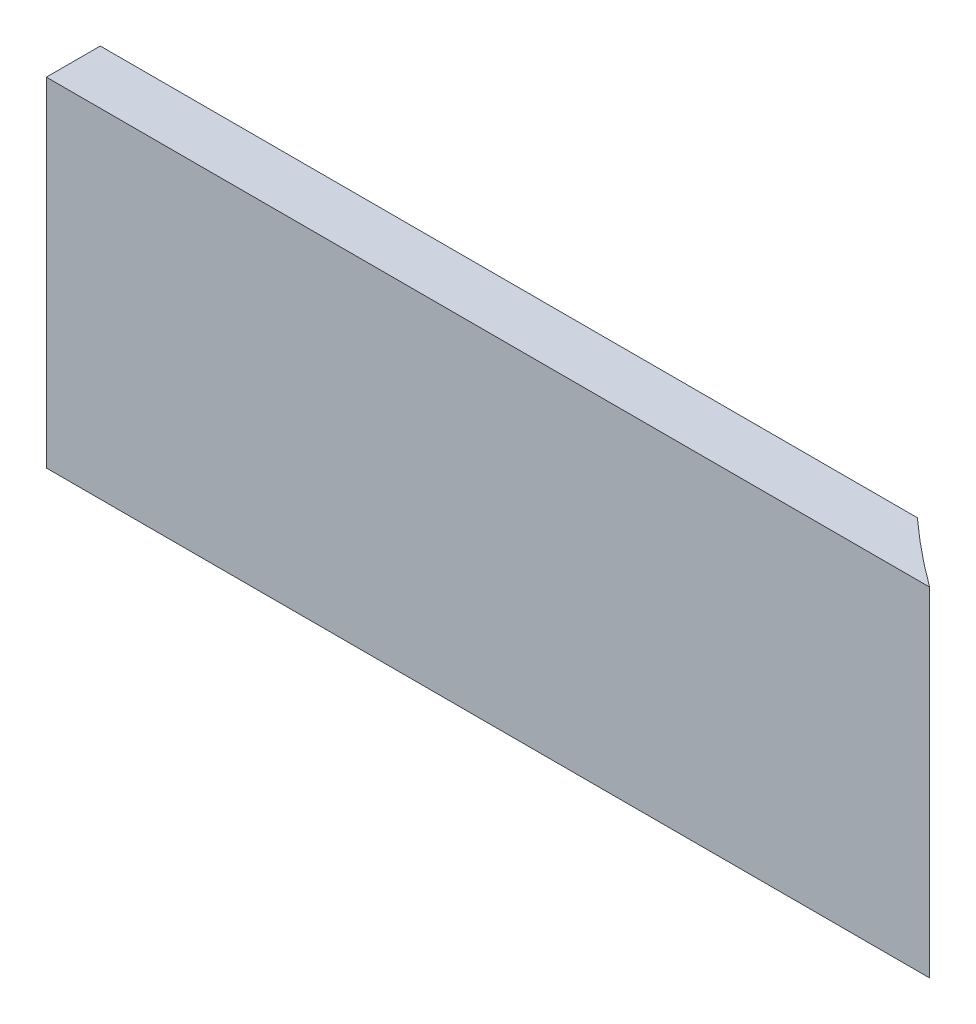
ISO-10303-21;
HEADER;
FILE_DESCRIPTION(('STEP AP214'),'2;1');
FILE_NAME('part.step','',(''),(''),'','','');
FILE_SCHEMA(('AUTOMOTIVE_DESIGN { 1 0 10303 214 1 1 1 1 }'));
ENDSEC;
DATA;
#1=APPLICATION_CONTEXT('core data for automotive mechanical design processes');
#2=APPLICATION_PROTOCOL_DEFINITION('international standard','automotive_design',2000,#1);
#3=PRODUCT_CONTEXT('',#1,'mechanical');
#4=PRODUCT('Part','Part','',(#3));
#5=PRODUCT_RELATED_PRODUCT_CATEGORY('part','',(#4));
#6=PRODUCT_DEFINITION_FORMATION('','',#4);
#7=PRODUCT_DEFINITION_CONTEXT('part definition',#1,'design');
#8=PRODUCT_DEFINITION('design','',#6,#7);
#9=PRODUCT_DEFINITION_SHAPE('','',#8);
#10=(LENGTH_UNIT() NAMED_UNIT(*) SI_UNIT(.MILLI.,.METRE.));
#11=(NAMED_UNIT(*) PLANE_ANGLE_UNIT() SI_UNIT($,.RADIAN.));
#12=(NAMED_UNIT(*) SI_UNIT($,.STERADIAN.) SOLID_ANGLE_UNIT());
#13=UNCERTAINTY_MEASURE_WITH_UNIT(LENGTH_MEASURE(1.E-05),#10,'distance_accuracy_value','');
#14=(GEOMETRIC_REPRESENTATION_CONTEXT(3) GLOBAL_UNCERTAINTY_ASSIGNED_CONTEXT((#13)) GLOBAL_UNIT_ASSIGNED_CONTEXT((#10,
#11,#12)) REPRESENTATION_CONTEXT('',''));
#15=CARTESIAN_POINT('',(0.,0.,0.));
#16=DIRECTION('',(0.,0.,1.));
#17=DIRECTION('',(1.,0.,0.));
#18=AXIS2_PLACEMENT_3D('',#15,#16,#17);
#19=CARTESIAN_POINT('',(297.5,-105.,33.45));
#20=DIRECTION('',(0.,1.,0.));
#21=DIRECTION('',(-1.,0.,0.));
#22=AXIS2_PLACEMENT_3D('',#19,#20,#21);
#23=PLANE('',#22);
#24=CARTESIAN_POINT('',(534.801270012683,-104.999999999997,-357.52304348203));
#25=DIRECTION('',(0.,-1.,0.));
#26=DIRECTION('',(0.87458306420189,0.,0.484875719964644));
#27=AXIS2_PLACEMENT_3D('',#24,#25,#26);
#28=CIRCLE('',#27,483.45);
#29=CARTESIAN_POINT('',(250.435340670944,-104.999999999999,33.4500000000107));
#30=VERTEX_POINT('',#29);
#31=CARTESIAN_POINT('',(209.376661417471,-105.,0.));
#32=VERTEX_POINT('',#31);
#33=EDGE_CURVE('E12',#30,#32,#28,.T.);
#34=ORIENTED_EDGE('',*,*,#33,.F.);
#35=DIRECTION('',(1.,0.,0.));
#36=VECTOR('',#35,1.);
#37=CARTESIAN_POINT('',(297.5,-105.,33.45));
#38=LINE('',#37,#36);
#39=CARTESIAN_POINT('',(-297.5,-105.,33.45));
#40=VERTEX_POINT('',#39);
#41=EDGE_CURVE('E95',#40,#30,#38,.T.);
#42=ORIENTED_EDGE('',*,*,#41,.F.);
#43=DIRECTION('',(0.,0.,-1.));
#44=VECTOR('',#43,1.);
#45=CARTESIAN_POINT('',(-297.5,-105.,33.45));
#46=LINE('',#45,#44);
#47=CARTESIAN_POINT('',(-297.5,-105.,0.));
#48=VERTEX_POINT('',#47);
#49=EDGE_CURVE('E98',#40,#48,#46,.T.);
#50=ORIENTED_EDGE('',*,*,#49,.T.);
#51=DIRECTION('',(1.,0.,0.));
#52=VECTOR('',#51,1.);
#53=CARTESIAN_POINT('',(297.5,-105.,0.));
#54=LINE('',#53,#52);
#55=EDGE_CURVE('E49',#48,#32,#54,.T.);
#56=ORIENTED_EDGE('',*,*,#55,.T.);
#57=EDGE_LOOP('',(#34,#42,#50,#56));
#58=FACE_BOUND('',#57,.T.);
#59=ADVANCED_FACE('F46',(#58),#23,.F.);
#60=CARTESIAN_POINT('',(297.5,105.,33.45));
#61=DIRECTION('',(0.,-1.,0.));
#62=DIRECTION('',(1.,0.,0.));
#63=AXIS2_PLACEMENT_3D('',#60,#61,#62);
#64=PLANE('',#63);
#65=DIRECTION('',(-1.,0.,0.));
#66=VECTOR('',#65,1.);
#67=CARTESIAN_POINT('',(297.5,105.,33.45));
#68=LINE('',#67,#66);
#69=CARTESIAN_POINT('',(250.435340670946,105.000000000001,33.4500000000128));
#70=VERTEX_POINT('',#69);
#71=CARTESIAN_POINT('',(-297.5,105.,33.45));
#72=VERTEX_POINT('',#71);
#73=EDGE_CURVE('E107',#70,#72,#68,.T.);
#74=ORIENTED_EDGE('',*,*,#73,.F.);
#75=CARTESIAN_POINT('',(534.801270012684,105.000000000003,-357.523043482027));
#76=DIRECTION('',(0.,-1.,0.));
#77=DIRECTION('',(0.87458306420189,0.,0.484875719964644));
#78=AXIS2_PLACEMENT_3D('',#75,#76,#77);
#79=CIRCLE('',#78,483.45);
#80=CARTESIAN_POINT('',(209.37666141747,105.000000000002,-1.11022302462516E-13));
#81=VERTEX_POINT('',#80);
#82=EDGE_CURVE('E73',#70,#81,#79,.T.);
#83=ORIENTED_EDGE('',*,*,#82,.T.);
#84=DIRECTION('',(-1.,0.,0.));
#85=VECTOR('',#84,1.);
#86=CARTESIAN_POINT('',(297.5,105.,0.));
#87=LINE('',#86,#85);
#88=CARTESIAN_POINT('',(-297.5,105.,0.));
#89=VERTEX_POINT('',#88);
#90=EDGE_CURVE('E89',#81,#89,#87,.T.);
#91=ORIENTED_EDGE('',*,*,#90,.T.);
#92=DIRECTION('',(0.,0.,-1.));
#93=VECTOR('',#92,1.);
#94=CARTESIAN_POINT('',(-297.5,105.,33.45));
#95=LINE('',#94,#93);
#96=EDGE_CURVE('E118',#72,#89,#95,.T.);
#97=ORIENTED_EDGE('',*,*,#96,.F.);
#98=EDGE_LOOP('',(#74,#83,#91,#97));
#99=FACE_BOUND('',#98,.T.);
#100=ADVANCED_FACE('F139',(#99),#64,.F.);
#101=CARTESIAN_POINT('',(0.,0.,33.45));
#102=DIRECTION('',(0.,0.,-1.));
#103=DIRECTION('',(-1.,0.,0.));
#104=AXIS2_PLACEMENT_3D('',#101,#102,#103);
#105=PLANE('',#104);
#106=DIRECTION('',(0.,1.,0.));
#107=VECTOR('',#106,1.);
#108=CARTESIAN_POINT('',(250.435340670944,-104.999999999999,33.4500000000106));
#109=LINE('',#108,#107);
#110=EDGE_CURVE('E56',#70,#30,#109,.F.);
#111=ORIENTED_EDGE('',*,*,#110,.F.);
#112=ORIENTED_EDGE('',*,*,#73,.T.);
#113=DIRECTION('',(0.,-1.,0.));
#114=VECTOR('',#113,1.);
#115=CARTESIAN_POINT('',(-297.5,105.,33.45));
#116=LINE('',#115,#114);
#117=EDGE_CURVE('E102',#72,#40,#116,.T.);
#118=ORIENTED_EDGE('',*,*,#117,.T.);
#119=ORIENTED_EDGE('',*,*,#41,.T.);
#120=EDGE_LOOP('',(#111,#112,#118,#119));
#121=FACE_BOUND('',#120,.T.);
#122=ADVANCED_FACE('F105',(#121),#105,.F.);
#123=CARTESIAN_POINT('',(0.,0.,0.));
#124=DIRECTION('',(0.,0.,-1.));
#125=DIRECTION('',(-1.,0.,0.));
#126=AXIS2_PLACEMENT_3D('',#123,#124,#125);
#127=PLANE('',#126);
#128=ORIENTED_EDGE('',*,*,#90,.F.);
#129=DIRECTION('',(0.,1.,0.));
#130=VECTOR('',#129,1.);
#131=CARTESIAN_POINT('',(209.376661417471,-104.999999999995,0.));
#132=LINE('',#131,#130);
#133=EDGE_CURVE('E64',#81,#32,#132,.F.);
#134=ORIENTED_EDGE('',*,*,#133,.T.);
#135=ORIENTED_EDGE('',*,*,#55,.F.);
#136=DIRECTION('',(0.,-1.,0.));
#137=VECTOR('',#136,1.);
#138=CARTESIAN_POINT('',(-297.5,105.,0.));
#139=LINE('',#138,#137);
#140=EDGE_CURVE('E112',#89,#48,#139,.T.);
#141=ORIENTED_EDGE('',*,*,#140,.F.);
#142=EDGE_LOOP('',(#128,#134,#135,#141));
#143=FACE_BOUND('',#142,.T.);
#144=ADVANCED_FACE('F130',(#143),#127,.T.);
#145=CARTESIAN_POINT('',(-297.5,105.,33.45));
#146=DIRECTION('',(1.,0.,0.));
#147=DIRECTION('',(0.,0.,-1.));
#148=AXIS2_PLACEMENT_3D('',#145,#146,#147);
#149=PLANE('',#148);
#150=ORIENTED_EDGE('',*,*,#140,.T.);
#151=ORIENTED_EDGE('',*,*,#49,.F.);
#152=ORIENTED_EDGE('',*,*,#117,.F.);
#153=ORIENTED_EDGE('',*,*,#96,.T.);
#154=EDGE_LOOP('',(#150,#151,#152,#153));
#155=FACE_BOUND('',#154,.T.);
#156=ADVANCED_FACE('F111',(#155),#149,.F.);
#157=CARTESIAN_POINT('',(534.801270012683,-104.999999999997,-357.52304348203));
#158=DIRECTION('',(0.,1.,0.));
#159=DIRECTION('',(-0.87458306420189,0.,-0.484875719964644));
#160=AXIS2_PLACEMENT_3D('',#157,#158,#159);
#161=CYLINDRICAL_SURFACE('',#160,483.45);
#162=ORIENTED_EDGE('',*,*,#82,.F.);
#163=ORIENTED_EDGE('',*,*,#110,.T.);
#164=ORIENTED_EDGE('',*,*,#33,.T.);
#165=ORIENTED_EDGE('',*,*,#133,.F.);
#166=EDGE_LOOP('',(#162,#163,#164,#165));
#167=FACE_BOUND('',#166,.T.);
#168=ADVANCED_FACE('F137',(#167),#161,.F.);
#169=CLOSED_SHELL('',(#59,#100,#122,#144,#156,#168));
#170=MANIFOLD_SOLID_BREP('B2',#169);
#171=ADVANCED_BREP_SHAPE_REPRESENTATION('',(#18,#170),#14);
#172=SHAPE_DEFINITION_REPRESENTATION(#9,#171);
ENDSEC;
END-ISO-10303-21;
